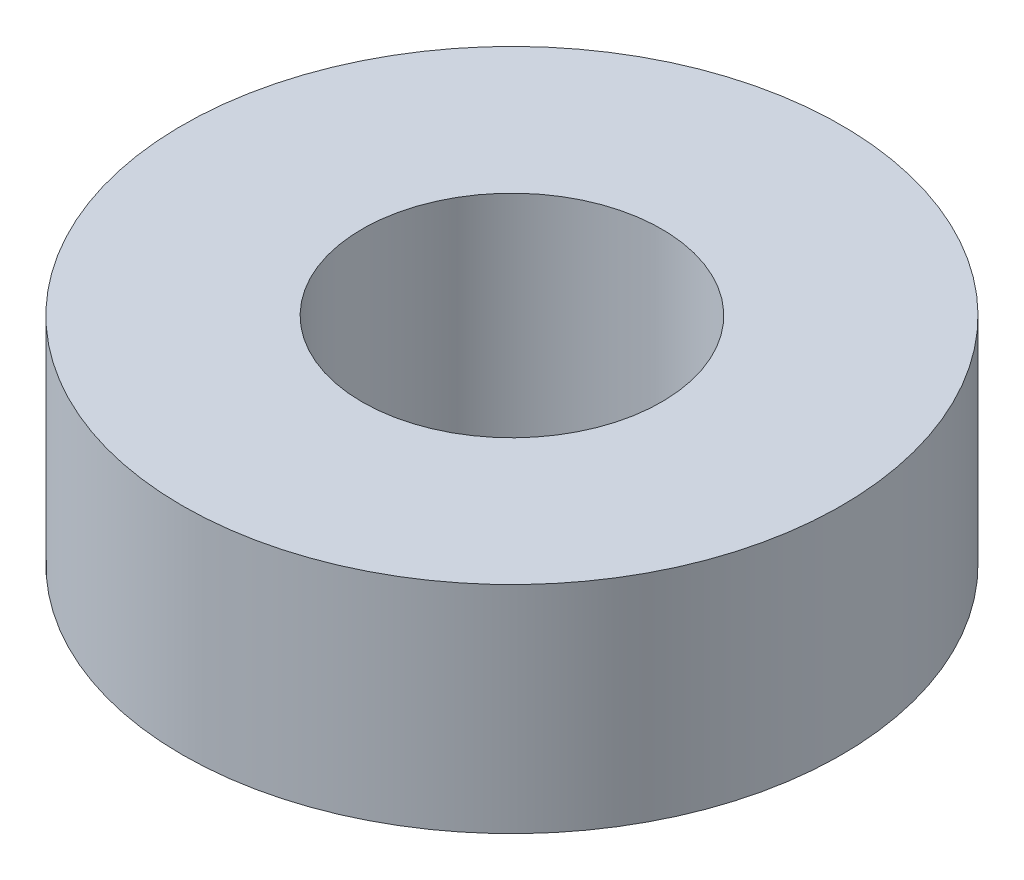
ISO-10303-21;
HEADER;
FILE_DESCRIPTION(('STEP AP214'),'2;1');
FILE_NAME('part.step','',(''),(''),'','','');
FILE_SCHEMA(('AUTOMOTIVE_DESIGN { 1 0 10303 214 1 1 1 1 }'));
ENDSEC;
DATA;
#1=APPLICATION_CONTEXT('core data for automotive mechanical design processes');
#2=APPLICATION_PROTOCOL_DEFINITION('international standard','automotive_design',2000,#1);
#3=PRODUCT_CONTEXT('',#1,'mechanical');
#4=PRODUCT('Part','Part','',(#3));
#5=PRODUCT_RELATED_PRODUCT_CATEGORY('part','',(#4));
#6=PRODUCT_DEFINITION_FORMATION('','',#4);
#7=PRODUCT_DEFINITION_CONTEXT('part definition',#1,'design');
#8=PRODUCT_DEFINITION('design','',#6,#7);
#9=PRODUCT_DEFINITION_SHAPE('','',#8);
#10=(LENGTH_UNIT() NAMED_UNIT(*) SI_UNIT(.MILLI.,.METRE.));
#11=(NAMED_UNIT(*) PLANE_ANGLE_UNIT() SI_UNIT($,.RADIAN.));
#12=(NAMED_UNIT(*) SI_UNIT($,.STERADIAN.) SOLID_ANGLE_UNIT());
#13=UNCERTAINTY_MEASURE_WITH_UNIT(LENGTH_MEASURE(1.E-05),#10,'distance_accuracy_value','');
#14=(GEOMETRIC_REPRESENTATION_CONTEXT(3) GLOBAL_UNCERTAINTY_ASSIGNED_CONTEXT((#13)) GLOBAL_UNIT_ASSIGNED_CONTEXT((#10,
#11,#12)) REPRESENTATION_CONTEXT('',''));
#15=CARTESIAN_POINT('',(0.,0.,0.));
#16=DIRECTION('',(0.,0.,1.));
#17=DIRECTION('',(1.,0.,0.));
#18=AXIS2_PLACEMENT_3D('',#15,#16,#17);
#19=CARTESIAN_POINT('',(0.,18.,0.));
#20=DIRECTION('',(0.,-1.,0.));
#21=DIRECTION('',(0.,0.,-1.));
#22=AXIS2_PLACEMENT_3D('',#19,#20,#21);
#23=CYLINDRICAL_SURFACE('',#22,27.5);
#24=CARTESIAN_POINT('',(0.,18.,0.));
#25=DIRECTION('',(0.,1.,0.));
#26=DIRECTION('',(0.,0.,1.));
#27=AXIS2_PLACEMENT_3D('',#24,#25,#26);
#28=CIRCLE('',#27,27.5);
#29=CARTESIAN_POINT('',(0.,18.,27.5));
#30=VERTEX_POINT('',#29);
#31=EDGE_CURVE('E10',#30,#30,#28,.T.);
#32=ORIENTED_EDGE('',*,*,#31,.F.);
#33=EDGE_LOOP('',(#32));
#34=FACE_BOUND('',#33,.T.);
#35=CARTESIAN_POINT('',(0.,0.,0.));
#36=DIRECTION('',(0.,1.,0.));
#37=DIRECTION('',(0.,0.,1.));
#38=AXIS2_PLACEMENT_3D('',#35,#36,#37);
#39=CIRCLE('',#38,27.5);
#40=CARTESIAN_POINT('',(0.,0.,27.5));
#41=VERTEX_POINT('',#40);
#42=EDGE_CURVE('E37',#41,#41,#39,.T.);
#43=ORIENTED_EDGE('',*,*,#42,.T.);
#44=EDGE_LOOP('',(#43));
#45=FACE_BOUND('',#44,.T.);
#46=ADVANCED_FACE('F40',(#34,#45),#23,.T.);
#47=CARTESIAN_POINT('',(0.,18.,0.));
#48=DIRECTION('',(0.,1.,0.));
#49=DIRECTION('',(0.,0.,1.));
#50=AXIS2_PLACEMENT_3D('',#47,#48,#49);
#51=PLANE('',#50);
#52=CARTESIAN_POINT('',(0.,18.,0.));
#53=DIRECTION('',(0.,1.,0.));
#54=DIRECTION('',(0.,0.,1.));
#55=AXIS2_PLACEMENT_3D('',#52,#53,#54);
#56=CIRCLE('',#55,12.5);
#57=CARTESIAN_POINT('',(0.,18.,12.5));
#58=VERTEX_POINT('',#57);
#59=EDGE_CURVE('E50',#58,#58,#56,.T.);
#60=ORIENTED_EDGE('',*,*,#59,.F.);
#61=EDGE_LOOP('',(#60));
#62=FACE_BOUND('',#61,.T.);
#63=ORIENTED_EDGE('',*,*,#31,.T.);
#64=EDGE_LOOP('',(#63));
#65=FACE_BOUND('',#64,.T.);
#66=ADVANCED_FACE('F59',(#62,#65),#51,.T.);
#67=CARTESIAN_POINT('',(0.,0.,0.));
#68=DIRECTION('',(0.,1.,0.));
#69=DIRECTION('',(0.,0.,1.));
#70=AXIS2_PLACEMENT_3D('',#67,#68,#69);
#71=PLANE('',#70);
#72=CARTESIAN_POINT('',(0.,0.,0.));
#73=DIRECTION('',(0.,1.,0.));
#74=DIRECTION('',(0.,0.,1.));
#75=AXIS2_PLACEMENT_3D('',#72,#73,#74);
#76=CIRCLE('',#75,12.5);
#77=CARTESIAN_POINT('',(0.,0.,12.5));
#78=VERTEX_POINT('',#77);
#79=EDGE_CURVE('E47',#78,#78,#76,.T.);
#80=ORIENTED_EDGE('',*,*,#79,.T.);
#81=EDGE_LOOP('',(#80));
#82=FACE_BOUND('',#81,.T.);
#83=ORIENTED_EDGE('',*,*,#42,.F.);
#84=EDGE_LOOP('',(#83));
#85=FACE_BOUND('',#84,.T.);
#86=ADVANCED_FACE('F58',(#82,#85),#71,.F.);
#87=CARTESIAN_POINT('',(0.,18.,0.));
#88=DIRECTION('',(0.,-1.,0.));
#89=DIRECTION('',(0.,0.,-1.));
#90=AXIS2_PLACEMENT_3D('',#87,#88,#89);
#91=CYLINDRICAL_SURFACE('',#90,12.5);
#92=ORIENTED_EDGE('',*,*,#59,.T.);
#93=EDGE_LOOP('',(#92));
#94=FACE_BOUND('',#93,.T.);
#95=ORIENTED_EDGE('',*,*,#79,.F.);
#96=EDGE_LOOP('',(#95));
#97=FACE_BOUND('',#96,.T.);
#98=ADVANCED_FACE('F54',(#94,#97),#91,.F.);
#99=CLOSED_SHELL('',(#46,#66,#86,#98));
#100=MANIFOLD_SOLID_BREP('B2',#99);
#101=ADVANCED_BREP_SHAPE_REPRESENTATION('',(#18,#100),#14);
#102=SHAPE_DEFINITION_REPRESENTATION(#9,#101);
ENDSEC;
END-ISO-10303-21;
